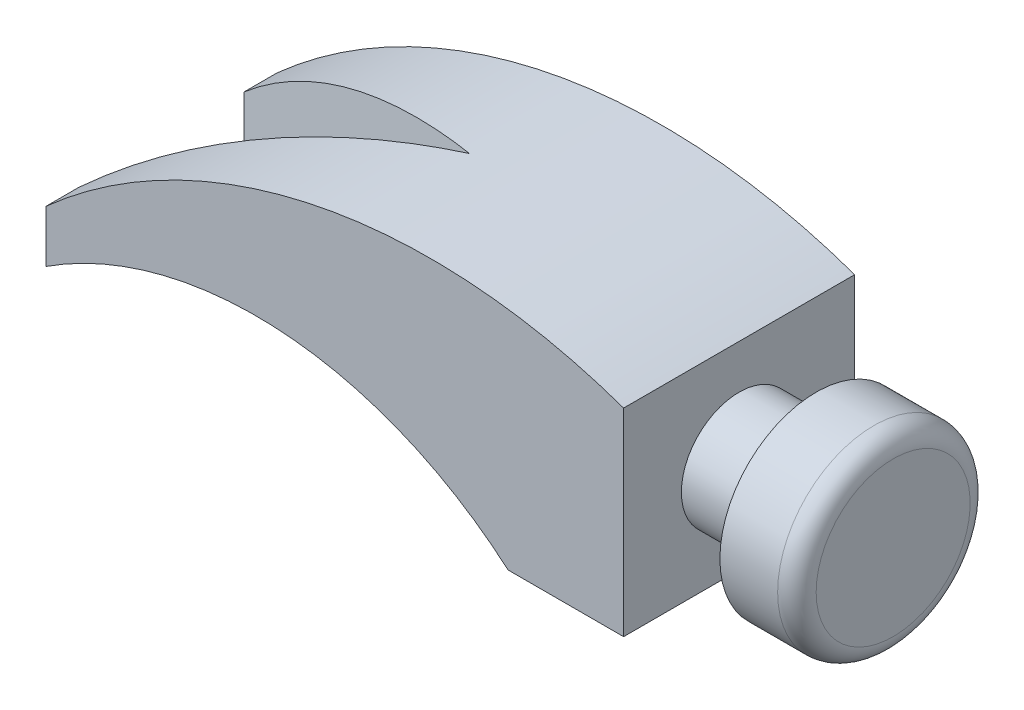
ISO-10303-21;
HEADER;
FILE_DESCRIPTION(('STEP AP214'),'2;1');
FILE_NAME('part.step','',(''),(''),'','','');
FILE_SCHEMA(('AUTOMOTIVE_DESIGN { 1 0 10303 214 1 1 1 1 }'));
ENDSEC;
DATA;
#1=APPLICATION_CONTEXT('core data for automotive mechanical design processes');
#2=APPLICATION_PROTOCOL_DEFINITION('international standard','automotive_design',2000,#1);
#3=PRODUCT_CONTEXT('',#1,'mechanical');
#4=PRODUCT('Part','Part','',(#3));
#5=PRODUCT_RELATED_PRODUCT_CATEGORY('part','',(#4));
#6=PRODUCT_DEFINITION_FORMATION('','',#4);
#7=PRODUCT_DEFINITION_CONTEXT('part definition',#1,'design');
#8=PRODUCT_DEFINITION('design','',#6,#7);
#9=PRODUCT_DEFINITION_SHAPE('','',#8);
#10=(LENGTH_UNIT() NAMED_UNIT(*) SI_UNIT(.MILLI.,.METRE.));
#11=(NAMED_UNIT(*) PLANE_ANGLE_UNIT() SI_UNIT($,.RADIAN.));
#12=(NAMED_UNIT(*) SI_UNIT($,.STERADIAN.) SOLID_ANGLE_UNIT());
#13=UNCERTAINTY_MEASURE_WITH_UNIT(LENGTH_MEASURE(1.E-05),#10,'distance_accuracy_value','');
#14=(GEOMETRIC_REPRESENTATION_CONTEXT(3) GLOBAL_UNCERTAINTY_ASSIGNED_CONTEXT((#13)) GLOBAL_UNIT_ASSIGNED_CONTEXT((#10,
#11,#12)) REPRESENTATION_CONTEXT('',''));
#15=CARTESIAN_POINT('',(0.,0.,0.));
#16=DIRECTION('',(0.,0.,1.));
#17=DIRECTION('',(1.,0.,0.));
#18=AXIS2_PLACEMENT_3D('',#15,#16,#17);
#19=CARTESIAN_POINT('',(-100.875235379488,-21.7638153603075,60.));
#20=DIRECTION('',(1.,0.,0.));
#21=DIRECTION('',(0.,1.,0.));
#22=AXIS2_PLACEMENT_3D('',#19,#20,#21);
#23=PLANE('',#22);
#24=DIRECTION('',(0.,1.,0.));
#25=VECTOR('',#24,1.);
#26=CARTESIAN_POINT('',(-100.875235379488,-50.,51.4197434116033));
#27=LINE('',#26,#25);
#28=CARTESIAN_POINT('',(-100.875235379488,-21.7638153603075,51.4197434116033));
#29=VERTEX_POINT('',#28);
#30=CARTESIAN_POINT('',(-100.875235379488,-8.23059706413196,51.4197434116033));
#31=VERTEX_POINT('',#30);
#32=EDGE_CURVE('E148',#29,#31,#27,.T.);
#33=ORIENTED_EDGE('',*,*,#32,.F.);
#34=DIRECTION('',(0.,0.,-1.));
#35=VECTOR('',#34,1.);
#36=CARTESIAN_POINT('',(-100.875235379488,-21.7638153603075,60.));
#37=LINE('',#36,#35);
#38=CARTESIAN_POINT('',(-100.875235379488,-21.7638153603075,60.));
#39=VERTEX_POINT('',#38);
#40=EDGE_CURVE('E119',#39,#29,#37,.T.);
#41=ORIENTED_EDGE('',*,*,#40,.F.);
#42=DIRECTION('',(0.,-1.,0.));
#43=VECTOR('',#42,1.);
#44=CARTESIAN_POINT('',(-100.875235379488,-21.7638153603075,60.));
#45=LINE('',#44,#43);
#46=CARTESIAN_POINT('',(-100.875235379488,-8.23059706413196,60.));
#47=VERTEX_POINT('',#46);
#48=EDGE_CURVE('E102',#47,#39,#45,.T.);
#49=ORIENTED_EDGE('',*,*,#48,.F.);
#50=DIRECTION('',(0.,0.,-1.));
#51=VECTOR('',#50,1.);
#52=CARTESIAN_POINT('',(-100.875235379488,-8.23059706413196,60.));
#53=LINE('',#52,#51);
#54=EDGE_CURVE('E109',#47,#31,#53,.T.);
#55=ORIENTED_EDGE('',*,*,#54,.T.);
#56=EDGE_LOOP('',(#33,#41,#49,#55));
#57=FACE_BOUND('',#56,.T.);
#58=ADVANCED_FACE('F36',(#57),#23,.F.);
#59=CARTESIAN_POINT('',(19.124764620512,-30.0339959391214,60.));
#60=DIRECTION('',(0.,1.,0.));
#61=DIRECTION('',(0.,0.,1.));
#62=AXIS2_PLACEMENT_3D('',#59,#60,#61);
#63=PLANE('',#62);
#64=DIRECTION('',(1.,0.,0.));
#65=VECTOR('',#64,1.);
#66=CARTESIAN_POINT('',(19.124764620512,-30.0339959391214,0.));
#67=LINE('',#66,#65);
#68=CARTESIAN_POINT('',(19.124764620512,-30.0339959391214,0.));
#69=VERTEX_POINT('',#68);
#70=CARTESIAN_POINT('',(49.124764620512,-30.0339959391214,0.));
#71=VERTEX_POINT('',#70);
#72=EDGE_CURVE('E125',#69,#71,#67,.T.);
#73=ORIENTED_EDGE('',*,*,#72,.T.);
#74=DIRECTION('',(0.,0.,-1.));
#75=VECTOR('',#74,1.);
#76=CARTESIAN_POINT('',(49.124764620512,-30.0339959391214,60.));
#77=LINE('',#76,#75);
#78=CARTESIAN_POINT('',(49.124764620512,-30.0339959391214,60.));
#79=VERTEX_POINT('',#78);
#80=EDGE_CURVE('E143',#79,#71,#77,.T.);
#81=ORIENTED_EDGE('',*,*,#80,.F.);
#82=DIRECTION('',(1.,0.,0.));
#83=VECTOR('',#82,1.);
#84=CARTESIAN_POINT('',(19.124764620512,-30.0339959391214,60.));
#85=LINE('',#84,#83);
#86=CARTESIAN_POINT('',(19.124764620512,-30.0339959391214,60.));
#87=VERTEX_POINT('',#86);
#88=EDGE_CURVE('E138',#87,#79,#85,.T.);
#89=ORIENTED_EDGE('',*,*,#88,.F.);
#90=DIRECTION('',(0.,0.,-1.));
#91=VECTOR('',#90,1.);
#92=CARTESIAN_POINT('',(19.124764620512,-30.0339959391214,60.));
#93=LINE('',#92,#91);
#94=EDGE_CURVE('E121',#87,#69,#93,.T.);
#95=ORIENTED_EDGE('',*,*,#94,.T.);
#96=EDGE_LOOP('',(#73,#81,#89,#95));
#97=FACE_BOUND('',#96,.T.);
#98=ADVANCED_FACE('F38',(#97),#63,.F.);
#99=CARTESIAN_POINT('',(49.124764620512,-30.0339959391214,60.));
#100=DIRECTION('',(-1.,0.,0.));
#101=DIRECTION('',(0.,0.,1.));
#102=AXIS2_PLACEMENT_3D('',#99,#100,#101);
#103=PLANE('',#102);
#104=CARTESIAN_POINT('',(49.124764620512,-5.03399593912143,30.));
#105=DIRECTION('',(-1.,0.,0.));
#106=DIRECTION('',(0.,0.,1.));
#107=AXIS2_PLACEMENT_3D('',#104,#105,#106);
#108=CIRCLE('',#107,15.);
#109=CARTESIAN_POINT('',(49.124764620512,-5.03399593912143,45.));
#110=VERTEX_POINT('',#109);
#111=EDGE_CURVE('E170',#110,#110,#108,.T.);
#112=ORIENTED_EDGE('',*,*,#111,.T.);
#113=EDGE_LOOP('',(#112));
#114=FACE_BOUND('',#113,.T.);
#115=DIRECTION('',(0.,1.,0.));
#116=VECTOR('',#115,1.);
#117=CARTESIAN_POINT('',(49.124764620512,-30.0339959391214,0.));
#118=LINE('',#117,#116);
#119=CARTESIAN_POINT('',(49.124764620512,21.3873602981881,0.));
#120=VERTEX_POINT('',#119);
#121=EDGE_CURVE('E128',#71,#120,#118,.T.);
#122=ORIENTED_EDGE('',*,*,#121,.T.);
#123=DIRECTION('',(0.,0.,-1.));
#124=VECTOR('',#123,1.);
#125=CARTESIAN_POINT('',(49.124764620512,21.3873602981881,60.));
#126=LINE('',#125,#124);
#127=CARTESIAN_POINT('',(49.124764620512,21.3873602981881,60.));
#128=VERTEX_POINT('',#127);
#129=EDGE_CURVE('E115',#128,#120,#126,.T.);
#130=ORIENTED_EDGE('',*,*,#129,.F.);
#131=DIRECTION('',(0.,1.,0.));
#132=VECTOR('',#131,1.);
#133=CARTESIAN_POINT('',(49.124764620512,-30.0339959391214,60.));
#134=LINE('',#133,#132);
#135=EDGE_CURVE('E92',#79,#128,#134,.T.);
#136=ORIENTED_EDGE('',*,*,#135,.F.);
#137=ORIENTED_EDGE('',*,*,#80,.T.);
#138=EDGE_LOOP('',(#122,#130,#136,#137));
#139=FACE_BOUND('',#138,.T.);
#140=ADVANCED_FACE('F195',(#114,#139),#103,.F.);
#141=CARTESIAN_POINT('',(-0.87523537948798,-120.033995939121,60.));
#142=DIRECTION('',(0.,0.,-1.));
#143=DIRECTION('',(-1.,0.,0.));
#144=AXIS2_PLACEMENT_3D('',#141,#142,#143);
#145=CYLINDRICAL_SURFACE('',#144,150.);
#146=CARTESIAN_POINT('',(-0.87523537948798,-120.033995939121,35.3630322540423));
#147=DIRECTION('',(0.259001456664931,0.,-0.965876930796799));
#148=DIRECTION('',(-0.965876930796799,0.,-0.259001456664931));
#149=AXIS2_PLACEMENT_3D('',#146,#147,#148);
#150=ELLIPSE('',#149,155.299288364055,150.);
#151=CARTESIAN_POINT('',(-100.875235379488,-8.23059706413196,8.54787098383077));
#152=VERTEX_POINT('',#151);
#153=CARTESIAN_POINT('',(-20.875235379488,28.6266915340636,30.));
#154=VERTEX_POINT('',#153);
#155=EDGE_CURVE('E173',#152,#154,#150,.T.);
#156=ORIENTED_EDGE('',*,*,#155,.T.);
#157=CARTESIAN_POINT('',(-0.87523537948798,-120.033995939121,24.6450641470992));
#158=DIRECTION('',(-0.258636624309396,0.,-0.965974687331837));
#159=DIRECTION('',(0.965974687331837,0.,-0.258636624309396));
#160=AXIS2_PLACEMENT_3D('',#157,#158,#159);
#161=ELLIPSE('',#160,155.283572092683,150.);
#162=EDGE_CURVE('E112',#31,#154,#161,.T.);
#163=ORIENTED_EDGE('',*,*,#162,.F.);
#164=ORIENTED_EDGE('',*,*,#54,.F.);
#165=CARTESIAN_POINT('',(-0.87523537948798,-120.033995939121,60.));
#166=DIRECTION('',(0.,0.,1.));
#167=DIRECTION('',(1.,0.,0.));
#168=AXIS2_PLACEMENT_3D('',#165,#166,#167);
#169=CIRCLE('',#168,150.);
#170=EDGE_CURVE('E98',#128,#47,#169,.T.);
#171=ORIENTED_EDGE('',*,*,#170,.F.);
#172=ORIENTED_EDGE('',*,*,#129,.T.);
#173=CARTESIAN_POINT('',(-0.87523537948798,-120.033995939121,0.));
#174=DIRECTION('',(0.,0.,1.));
#175=DIRECTION('',(1.,0.,0.));
#176=AXIS2_PLACEMENT_3D('',#173,#174,#175);
#177=CIRCLE('',#176,150.);
#178=CARTESIAN_POINT('',(-100.875235379488,-8.23059706413196,0.));
#179=VERTEX_POINT('',#178);
#180=EDGE_CURVE('E131',#120,#179,#177,.T.);
#181=ORIENTED_EDGE('',*,*,#180,.T.);
#182=EDGE_CURVE('E116',#152,#179,#53,.T.);
#183=ORIENTED_EDGE('',*,*,#182,.F.);
#184=EDGE_LOOP('',(#156,#163,#164,#171,#172,#181,#183));
#185=FACE_BOUND('',#184,.T.);
#186=ADVANCED_FACE('F111',(#185),#145,.T.);
#187=CARTESIAN_POINT('',(-100.875235379488,-21.7638153603075,8.54787098383077));
#188=VERTEX_POINT('',#187);
#189=CARTESIAN_POINT('',(-100.875235379488,-21.7638153603075,0.));
#190=VERTEX_POINT('',#189);
#191=EDGE_CURVE('E140',#188,#190,#37,.T.);
#192=ORIENTED_EDGE('',*,*,#191,.F.);
#193=DIRECTION('',(0.,1.,0.));
#194=VECTOR('',#193,1.);
#195=CARTESIAN_POINT('',(-100.875235379488,-50.,8.54787098383077));
#196=LINE('',#195,#194);
#197=EDGE_CURVE('E150',#188,#152,#196,.T.);
#198=ORIENTED_EDGE('',*,*,#197,.T.);
#199=ORIENTED_EDGE('',*,*,#182,.T.);
#200=DIRECTION('',(0.,-1.,0.));
#201=VECTOR('',#200,1.);
#202=CARTESIAN_POINT('',(-100.875235379488,-21.7638153603075,0.));
#203=LINE('',#202,#201);
#204=EDGE_CURVE('E134',#179,#190,#203,.T.);
#205=ORIENTED_EDGE('',*,*,#204,.T.);
#206=EDGE_LOOP('',(#192,#198,#199,#205));
#207=FACE_BOUND('',#206,.T.);
#208=ADVANCED_FACE('F190',(#207),#23,.F.);
#209=CARTESIAN_POINT('',(-46.3682892212722,-105.602904218103,60.));
#210=DIRECTION('',(0.,0.,-1.));
#211=DIRECTION('',(-1.,0.,0.));
#212=AXIS2_PLACEMENT_3D('',#209,#210,#211);
#213=CYLINDRICAL_SURFACE('',#212,100.);
#214=CARTESIAN_POINT('',(-46.3682892212722,-105.602904218103,36.8256834008651));
#215=DIRECTION('',(-0.258636624309396,0.,-0.965974687331837));
#216=DIRECTION('',(0.965974687331837,0.,-0.258636624309396));
#217=AXIS2_PLACEMENT_3D('',#214,#215,#216);
#218=ELLIPSE('',#217,103.522381395122,100.);
#219=CARTESIAN_POINT('',(-20.875235379488,-8.90696735506902,30.));
#220=VERTEX_POINT('',#219);
#221=EDGE_CURVE('E44',#220,#29,#218,.F.);
#222=ORIENTED_EDGE('',*,*,#221,.F.);
#223=CARTESIAN_POINT('',(-46.3682892212722,-105.602904218103,23.1639964996237));
#224=DIRECTION('',(0.259001456664931,0.,-0.965876930796799));
#225=DIRECTION('',(-0.965876930796799,0.,-0.259001456664931));
#226=AXIS2_PLACEMENT_3D('',#223,#224,#225);
#227=ELLIPSE('',#226,103.53285890937,100.);
#228=EDGE_CURVE('E11',#220,#188,#227,.F.);
#229=ORIENTED_EDGE('',*,*,#228,.T.);
#230=ORIENTED_EDGE('',*,*,#191,.T.);
#231=CARTESIAN_POINT('',(-46.3682892212722,-105.602904218103,0.));
#232=DIRECTION('',(0.,0.,-1.));
#233=DIRECTION('',(1.,0.,0.));
#234=AXIS2_PLACEMENT_3D('',#231,#232,#233);
#235=CIRCLE('',#234,100.);
#236=EDGE_CURVE('E83',#190,#69,#235,.T.);
#237=ORIENTED_EDGE('',*,*,#236,.T.);
#238=ORIENTED_EDGE('',*,*,#94,.F.);
#239=CARTESIAN_POINT('',(-46.3682892212722,-105.602904218103,60.));
#240=DIRECTION('',(0.,0.,-1.));
#241=DIRECTION('',(1.,0.,0.));
#242=AXIS2_PLACEMENT_3D('',#239,#240,#241);
#243=CIRCLE('',#242,100.);
#244=EDGE_CURVE('E60',#39,#87,#243,.T.);
#245=ORIENTED_EDGE('',*,*,#244,.F.);
#246=ORIENTED_EDGE('',*,*,#40,.T.);
#247=EDGE_LOOP('',(#222,#229,#230,#237,#238,#245,#246));
#248=FACE_BOUND('',#247,.T.);
#249=ADVANCED_FACE('F152',(#248),#213,.F.);
#250=CARTESIAN_POINT('',(-0.87523537948798,-120.033995939121,60.));
#251=DIRECTION('',(0.,0.,1.));
#252=DIRECTION('',(1.,0.,0.));
#253=AXIS2_PLACEMENT_3D('',#250,#251,#252);
#254=PLANE('',#253);
#255=ORIENTED_EDGE('',*,*,#88,.T.);
#256=ORIENTED_EDGE('',*,*,#135,.T.);
#257=ORIENTED_EDGE('',*,*,#170,.T.);
#258=ORIENTED_EDGE('',*,*,#48,.T.);
#259=ORIENTED_EDGE('',*,*,#244,.T.);
#260=EDGE_LOOP('',(#255,#256,#257,#258,#259));
#261=FACE_BOUND('',#260,.T.);
#262=ADVANCED_FACE('F100',(#261),#254,.T.);
#263=CARTESIAN_POINT('',(-0.87523537948798,-120.033995939121,0.));
#264=DIRECTION('',(0.,0.,1.));
#265=DIRECTION('',(1.,0.,0.));
#266=AXIS2_PLACEMENT_3D('',#263,#264,#265);
#267=PLANE('',#266);
#268=ORIENTED_EDGE('',*,*,#72,.F.);
#269=ORIENTED_EDGE('',*,*,#236,.F.);
#270=ORIENTED_EDGE('',*,*,#204,.F.);
#271=ORIENTED_EDGE('',*,*,#180,.F.);
#272=ORIENTED_EDGE('',*,*,#121,.F.);
#273=EDGE_LOOP('',(#268,#269,#270,#271,#272));
#274=FACE_BOUND('',#273,.T.);
#275=ADVANCED_FACE('F194',(#274),#267,.F.);
#276=CARTESIAN_POINT('',(89.124764620512,14.9660040608786,30.));
#277=DIRECTION('',(-1.,0.,0.));
#278=DIRECTION('',(0.,0.,1.));
#279=AXIS2_PLACEMENT_3D('',#276,#277,#278);
#280=PLANE('',#279);
#281=CARTESIAN_POINT('',(89.124764620512,-5.03399593912143,30.));
#282=DIRECTION('',(-1.,0.,0.));
#283=DIRECTION('',(0.,0.,1.));
#284=AXIS2_PLACEMENT_3D('',#281,#282,#283);
#285=CIRCLE('',#284,20.);
#286=CARTESIAN_POINT('',(89.124764620512,-5.03399593912143,50.));
#287=VERTEX_POINT('',#286);
#288=EDGE_CURVE('E129',#287,#287,#285,.T.);
#289=ORIENTED_EDGE('',*,*,#288,.F.);
#290=EDGE_LOOP('',(#289));
#291=FACE_BOUND('',#290,.T.);
#292=ADVANCED_FACE('F218',(#291),#280,.F.);
#293=CARTESIAN_POINT('',(84.124764620512,-5.03399593912143,30.));
#294=DIRECTION('',(-1.,0.,0.));
#295=DIRECTION('',(0.,0.,1.));
#296=AXIS2_PLACEMENT_3D('',#293,#294,#295);
#297=TOROIDAL_SURFACE('',#296,20.,5.);
#298=CARTESIAN_POINT('',(84.124764620512,-5.03399593912143,30.));
#299=DIRECTION('',(-1.,0.,0.));
#300=DIRECTION('',(0.,0.,1.));
#301=AXIS2_PLACEMENT_3D('',#298,#299,#300);
#302=CIRCLE('',#301,25.);
#303=CARTESIAN_POINT('',(84.124764620512,-5.03399593912143,55.));
#304=VERTEX_POINT('',#303);
#305=EDGE_CURVE('E161',#304,#304,#302,.T.);
#306=ORIENTED_EDGE('',*,*,#305,.F.);
#307=EDGE_LOOP('',(#306));
#308=FACE_BOUND('',#307,.T.);
#309=ORIENTED_EDGE('',*,*,#288,.T.);
#310=EDGE_LOOP('',(#309));
#311=FACE_BOUND('',#310,.T.);
#312=ADVANCED_FACE('F222',(#308,#311),#297,.T.);
#313=CARTESIAN_POINT('',(49.124764620512,-5.03399593912143,30.));
#314=DIRECTION('',(-1.,0.,0.));
#315=DIRECTION('',(0.,0.,1.));
#316=AXIS2_PLACEMENT_3D('',#313,#314,#315);
#317=CYLINDRICAL_SURFACE('',#316,25.);
#318=CARTESIAN_POINT('',(69.124764620512,-5.03399593912143,30.));
#319=DIRECTION('',(-1.,0.,0.));
#320=DIRECTION('',(0.,0.,1.));
#321=AXIS2_PLACEMENT_3D('',#318,#319,#320);
#322=CIRCLE('',#321,25.);
#323=CARTESIAN_POINT('',(69.124764620512,-5.03399593912143,55.));
#324=VERTEX_POINT('',#323);
#325=EDGE_CURVE('E164',#324,#324,#322,.T.);
#326=ORIENTED_EDGE('',*,*,#325,.F.);
#327=EDGE_LOOP('',(#326));
#328=FACE_BOUND('',#327,.T.);
#329=ORIENTED_EDGE('',*,*,#305,.T.);
#330=EDGE_LOOP('',(#329));
#331=FACE_BOUND('',#330,.T.);
#332=ADVANCED_FACE('F226',(#328,#331),#317,.T.);
#333=CARTESIAN_POINT('',(69.124764620512,9.96600406087857,30.));
#334=DIRECTION('',(1.,0.,0.));
#335=DIRECTION('',(0.,0.,-1.));
#336=AXIS2_PLACEMENT_3D('',#333,#334,#335);
#337=PLANE('',#336);
#338=CARTESIAN_POINT('',(69.124764620512,-5.03399593912143,30.));
#339=DIRECTION('',(-1.,0.,0.));
#340=DIRECTION('',(0.,0.,1.));
#341=AXIS2_PLACEMENT_3D('',#338,#339,#340);
#342=CIRCLE('',#341,15.);
#343=CARTESIAN_POINT('',(69.124764620512,-5.03399593912143,45.));
#344=VERTEX_POINT('',#343);
#345=EDGE_CURVE('E167',#344,#344,#342,.T.);
#346=ORIENTED_EDGE('',*,*,#345,.F.);
#347=EDGE_LOOP('',(#346));
#348=FACE_BOUND('',#347,.T.);
#349=ORIENTED_EDGE('',*,*,#325,.T.);
#350=EDGE_LOOP('',(#349));
#351=FACE_BOUND('',#350,.T.);
#352=ADVANCED_FACE('F230',(#348,#351),#337,.F.);
#353=CARTESIAN_POINT('',(49.124764620512,-5.03399593912143,30.));
#354=DIRECTION('',(-1.,0.,0.));
#355=DIRECTION('',(0.,0.,1.));
#356=AXIS2_PLACEMENT_3D('',#353,#354,#355);
#357=CYLINDRICAL_SURFACE('',#356,15.);
#358=ORIENTED_EDGE('',*,*,#111,.F.);
#359=EDGE_LOOP('',(#358));
#360=FACE_BOUND('',#359,.T.);
#361=ORIENTED_EDGE('',*,*,#345,.T.);
#362=EDGE_LOOP('',(#361));
#363=FACE_BOUND('',#362,.T.);
#364=ADVANCED_FACE('F234',(#360,#363),#357,.T.);
#365=CARTESIAN_POINT('',(-20.875235379488,-50.,30.));
#366=DIRECTION('',(0.259001456664931,0.,-0.965876930796799));
#367=DIRECTION('',(-0.965876930796799,0.,-0.259001456664931));
#368=AXIS2_PLACEMENT_3D('',#365,#366,#367);
#369=PLANE('',#368);
#370=ORIENTED_EDGE('',*,*,#197,.F.);
#371=ORIENTED_EDGE('',*,*,#228,.F.);
#372=DIRECTION('',(0.,1.,0.));
#373=VECTOR('',#372,1.);
#374=CARTESIAN_POINT('',(-20.875235379488,-50.,30.));
#375=LINE('',#374,#373);
#376=EDGE_CURVE('E51',#220,#154,#375,.T.);
#377=ORIENTED_EDGE('',*,*,#376,.T.);
#378=ORIENTED_EDGE('',*,*,#155,.F.);
#379=EDGE_LOOP('',(#370,#371,#377,#378));
#380=FACE_BOUND('',#379,.T.);
#381=ADVANCED_FACE('F182',(#380),#369,.F.);
#382=CARTESIAN_POINT('',(-20.875235379488,-50.,30.));
#383=DIRECTION('',(-0.258636624309396,0.,-0.965974687331837));
#384=DIRECTION('',(-0.965974687331837,0.,0.258636624309396));
#385=AXIS2_PLACEMENT_3D('',#382,#383,#384);
#386=PLANE('',#385);
#387=ORIENTED_EDGE('',*,*,#162,.T.);
#388=ORIENTED_EDGE('',*,*,#376,.F.);
#389=ORIENTED_EDGE('',*,*,#221,.T.);
#390=ORIENTED_EDGE('',*,*,#32,.T.);
#391=EDGE_LOOP('',(#387,#388,#389,#390));
#392=FACE_BOUND('',#391,.T.);
#393=ADVANCED_FACE('F147',(#392),#386,.T.);
#394=CLOSED_SHELL('',(#58,#98,#140,#186,#208,#249,#262,#275,#292,#312,#332,#352,#364,#381,#393));
#395=MANIFOLD_SOLID_BREP('B2',#394);
#396=ADVANCED_BREP_SHAPE_REPRESENTATION('',(#18,#395),#14);
#397=SHAPE_DEFINITION_REPRESENTATION(#9,#396);
ENDSEC;
END-ISO-10303-21;
